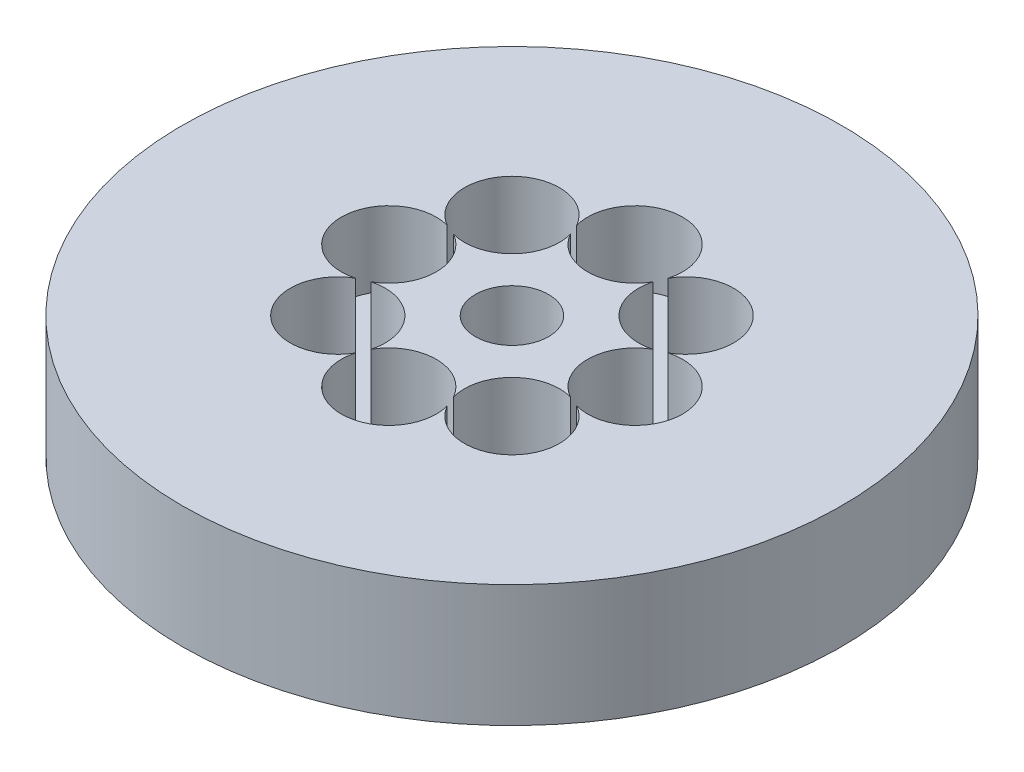
ISO-10303-21;
HEADER;
FILE_DESCRIPTION(('STEP AP214'),'2;1');
FILE_NAME('part.step','',(''),(''),'','','');
FILE_SCHEMA(('AUTOMOTIVE_DESIGN { 1 0 10303 214 1 1 1 1 }'));
ENDSEC;
DATA;
#1=APPLICATION_CONTEXT('core data for automotive mechanical design processes');
#2=APPLICATION_PROTOCOL_DEFINITION('international standard','automotive_design',2000,#1);
#3=PRODUCT_CONTEXT('',#1,'mechanical');
#4=PRODUCT('Part','Part','',(#3));
#5=PRODUCT_RELATED_PRODUCT_CATEGORY('part','',(#4));
#6=PRODUCT_DEFINITION_FORMATION('','',#4);
#7=PRODUCT_DEFINITION_CONTEXT('part definition',#1,'design');
#8=PRODUCT_DEFINITION('design','',#6,#7);
#9=PRODUCT_DEFINITION_SHAPE('','',#8);
#10=(LENGTH_UNIT() NAMED_UNIT(*) SI_UNIT(.MILLI.,.METRE.));
#11=(NAMED_UNIT(*) PLANE_ANGLE_UNIT() SI_UNIT($,.RADIAN.));
#12=(NAMED_UNIT(*) SI_UNIT($,.STERADIAN.) SOLID_ANGLE_UNIT());
#13=UNCERTAINTY_MEASURE_WITH_UNIT(LENGTH_MEASURE(1.E-05),#10,'distance_accuracy_value','');
#14=(GEOMETRIC_REPRESENTATION_CONTEXT(3) GLOBAL_UNCERTAINTY_ASSIGNED_CONTEXT((#13)) GLOBAL_UNIT_ASSIGNED_CONTEXT((#10,
#11,#12)) REPRESENTATION_CONTEXT('',''));
#15=CARTESIAN_POINT('',(0.,0.,0.));
#16=DIRECTION('',(0.,0.,1.));
#17=DIRECTION('',(1.,0.,0.));
#18=AXIS2_PLACEMENT_3D('',#15,#16,#17);
#19=CARTESIAN_POINT('',(0.,25.,0.));
#20=DIRECTION('',(0.,1.,0.));
#21=DIRECTION('',(0.,0.,1.));
#22=AXIS2_PLACEMENT_3D('',#19,#20,#21);
#23=PLANE('',#22);
#24=CARTESIAN_POINT('',(-17.835836391274,25.,17.8358363912741));
#25=DIRECTION('',(0.,1.,0.));
#26=DIRECTION('',(0.707106781186549,0.,0.707106781186546));
#27=AXIS2_PLACEMENT_3D('',#24,#25,#26);
#28=CIRCLE('',#27,9.72663135384918);
#29=CARTESIAN_POINT('',(-8.45981113762226,25.,20.4237907835628));
#30=VERTEX_POINT('',#29);
#31=CARTESIAN_POINT('',(-20.4237907835627,25.,8.45981113762233));
#32=VERTEX_POINT('',#31);
#33=EDGE_CURVE('E248',#30,#32,#28,.T.);
#34=ORIENTED_EDGE('',*,*,#33,.F.);
#35=CARTESIAN_POINT('',(0.,25.,25.2236817208074));
#36=DIRECTION('',(0.,1.,0.));
#37=DIRECTION('',(1.,0.,0.));
#38=AXIS2_PLACEMENT_3D('',#35,#36,#37);
#39=CIRCLE('',#38,9.72663135384918);
#40=CARTESIAN_POINT('',(8.4598111376224,25.,20.4237907835627));
#41=VERTEX_POINT('',#40);
#42=EDGE_CURVE('E230',#41,#30,#39,.T.);
#43=ORIENTED_EDGE('',*,*,#42,.F.);
#44=CARTESIAN_POINT('',(17.8358363912741,25.,17.835836391274));
#45=DIRECTION('',(0.,1.,0.));
#46=DIRECTION('',(0.707106781186544,0.,-0.707106781186551));
#47=AXIS2_PLACEMENT_3D('',#44,#45,#46);
#48=CIRCLE('',#47,9.72663135384918);
#49=CARTESIAN_POINT('',(20.4237907835622,25.,8.45981113762202));
#50=VERTEX_POINT('',#49);
#51=EDGE_CURVE('E204',#50,#41,#48,.T.);
#52=ORIENTED_EDGE('',*,*,#51,.F.);
#53=CARTESIAN_POINT('',(25.2236817208074,25.,0.));
#54=DIRECTION('',(0.,1.,0.));
#55=DIRECTION('',(0.,0.,-1.));
#56=AXIS2_PLACEMENT_3D('',#53,#54,#55);
#57=CIRCLE('',#56,9.72663135384918);
#58=CARTESIAN_POINT('',(20.4237907835633,25.,-8.45981113762264));
#59=VERTEX_POINT('',#58);
#60=EDGE_CURVE('E206',#59,#50,#57,.T.);
#61=ORIENTED_EDGE('',*,*,#60,.F.);
#62=CARTESIAN_POINT('',(17.8358363912739,25.,-17.8358363912742));
#63=DIRECTION('',(0.,1.,0.));
#64=DIRECTION('',(-0.707106781186554,0.,-0.707106781186541));
#65=AXIS2_PLACEMENT_3D('',#62,#63,#64);
#66=CIRCLE('',#65,9.72663135384918);
#67=CARTESIAN_POINT('',(8.45981113762211,25.,-20.4237907835628));
#68=VERTEX_POINT('',#67);
#69=EDGE_CURVE('E186',#68,#59,#66,.T.);
#70=ORIENTED_EDGE('',*,*,#69,.F.);
#71=CARTESIAN_POINT('',(-2.64204042075353E-13,25.,-25.2236817208074));
#72=DIRECTION('',(0.,1.,0.));
#73=DIRECTION('',(-1.,0.,0.));
#74=AXIS2_PLACEMENT_3D('',#71,#72,#73);
#75=CIRCLE('',#74,9.72663135384918);
#76=CARTESIAN_POINT('',(-8.45981113762254,25.,-20.4237907835626));
#77=VERTEX_POINT('',#76);
#78=EDGE_CURVE('E163',#77,#68,#75,.T.);
#79=ORIENTED_EDGE('',*,*,#78,.F.);
#80=CARTESIAN_POINT('',(-17.8358363912743,25.,-17.8358363912738));
#81=DIRECTION('',(0.,1.,0.));
#82=DIRECTION('',(-0.707106781186539,0.,0.707106781186556));
#83=AXIS2_PLACEMENT_3D('',#80,#81,#82);
#84=CIRCLE('',#83,9.72663135384918);
#85=CARTESIAN_POINT('',(-20.4237907835617,25.,-8.45981113762171));
#86=VERTEX_POINT('',#85);
#87=EDGE_CURVE('E182',#86,#77,#84,.T.);
#88=ORIENTED_EDGE('',*,*,#87,.F.);
#89=CARTESIAN_POINT('',(-25.2236817208074,25.,0.));
#90=DIRECTION('',(0.,1.,0.));
#91=DIRECTION('',(0.,0.,1.));
#92=AXIS2_PLACEMENT_3D('',#89,#90,#91);
#93=CIRCLE('',#92,9.72663135384918);
#94=EDGE_CURVE('E261',#32,#86,#93,.T.);
#95=ORIENTED_EDGE('',*,*,#94,.F.);
#96=EDGE_LOOP('',(#34,#43,#52,#61,#70,#79,#88,#95));
#97=FACE_BOUND('',#96,.T.);
#98=CARTESIAN_POINT('',(0.,25.,0.));
#99=DIRECTION('',(0.,1.,0.));
#100=DIRECTION('',(0.,0.,1.));
#101=AXIS2_PLACEMENT_3D('',#98,#99,#100);
#102=CIRCLE('',#101,7.5);
#103=CARTESIAN_POINT('',(0.,25.,7.5));
#104=VERTEX_POINT('',#103);
#105=EDGE_CURVE('E262',#104,#104,#102,.T.);
#106=ORIENTED_EDGE('',*,*,#105,.F.);
#107=EDGE_LOOP('',(#106));
#108=FACE_BOUND('',#107,.T.);
#109=ADVANCED_FACE('F39',(#97,#108),#23,.T.);
#110=CARTESIAN_POINT('',(-25.2236817208074,9.76931969027989,0.));
#111=DIRECTION('',(0.,1.,0.));
#112=DIRECTION('',(0.,0.,1.));
#113=AXIS2_PLACEMENT_3D('',#110,#111,#112);
#114=CYLINDRICAL_SURFACE('',#113,9.72663135384918);
#115=CARTESIAN_POINT('',(-25.2236817208074,9.76931969027989,0.));
#116=DIRECTION('',(0.,1.,0.));
#117=DIRECTION('',(0.,0.,1.));
#118=AXIS2_PLACEMENT_3D('',#115,#116,#117);
#119=CIRCLE('',#118,9.72663135384918);
#120=CARTESIAN_POINT('',(-20.4237907835627,9.76931969027989,8.45981113762233));
#121=VERTEX_POINT('',#120);
#122=CARTESIAN_POINT('',(-20.4237907835617,9.76931969027989,-8.45981113762172));
#123=VERTEX_POINT('',#122);
#124=EDGE_CURVE('E257',#121,#123,#119,.T.);
#125=ORIENTED_EDGE('',*,*,#124,.F.);
#126=DIRECTION('',(0.,1.,0.));
#127=VECTOR('',#126,1.);
#128=CARTESIAN_POINT('',(-20.4237907835627,17.3846598451399,8.45981113762233));
#129=LINE('',#128,#127);
#130=EDGE_CURVE('E255',#121,#32,#129,.T.);
#131=ORIENTED_EDGE('',*,*,#130,.T.);
#132=ORIENTED_EDGE('',*,*,#94,.T.);
#133=DIRECTION('',(0.,1.,0.));
#134=VECTOR('',#133,1.);
#135=CARTESIAN_POINT('',(-20.4237907835617,17.3846598451399,-8.45981113762171));
#136=LINE('',#135,#134);
#137=EDGE_CURVE('E250',#86,#123,#136,.F.);
#138=ORIENTED_EDGE('',*,*,#137,.T.);
#139=EDGE_LOOP('',(#125,#131,#132,#138));
#140=FACE_BOUND('',#139,.T.);
#141=ADVANCED_FACE('F277',(#140),#114,.F.);
#142=CARTESIAN_POINT('',(0.,25.,0.));
#143=DIRECTION('',(0.,-1.,0.));
#144=DIRECTION('',(0.,0.,-1.));
#145=AXIS2_PLACEMENT_3D('',#142,#143,#144);
#146=CYLINDRICAL_SURFACE('',#145,67.5);
#147=CARTESIAN_POINT('',(0.,25.,0.));
#148=DIRECTION('',(0.,1.,0.));
#149=DIRECTION('',(0.,0.,1.));
#150=AXIS2_PLACEMENT_3D('',#147,#148,#149);
#151=CIRCLE('',#150,67.5);
#152=CARTESIAN_POINT('',(0.,25.,67.5));
#153=VERTEX_POINT('',#152);
#154=EDGE_CURVE('E11',#153,#153,#151,.T.);
#155=ORIENTED_EDGE('',*,*,#154,.F.);
#156=EDGE_LOOP('',(#155));
#157=FACE_BOUND('',#156,.T.);
#158=CARTESIAN_POINT('',(0.,0.,0.));
#159=DIRECTION('',(0.,1.,0.));
#160=DIRECTION('',(0.,0.,1.));
#161=AXIS2_PLACEMENT_3D('',#158,#159,#160);
#162=CIRCLE('',#161,67.5);
#163=CARTESIAN_POINT('',(0.,0.,67.5));
#164=VERTEX_POINT('',#163);
#165=EDGE_CURVE('E43',#164,#164,#162,.T.);
#166=ORIENTED_EDGE('',*,*,#165,.T.);
#167=EDGE_LOOP('',(#166));
#168=FACE_BOUND('',#167,.T.);
#169=ADVANCED_FACE('F41',(#157,#168),#146,.T.);
#170=CARTESIAN_POINT('',(-22.6357273285186,25.,9.37602525365175));
#171=VERTEX_POINT('',#170);
#172=CARTESIAN_POINT('',(-9.37602525365167,25.,22.6357273285187));
#173=VERTEX_POINT('',#172);
#174=EDGE_CURVE('E242',#171,#173,#28,.T.);
#175=ORIENTED_EDGE('',*,*,#174,.F.);
#176=CARTESIAN_POINT('',(-22.63572732852,25.,-9.37602525365212));
#177=VERTEX_POINT('',#176);
#178=EDGE_CURVE('E260',#177,#171,#93,.T.);
#179=ORIENTED_EDGE('',*,*,#178,.F.);
#180=CARTESIAN_POINT('',(-9.37602525365199,25.,-22.6357273285185));
#181=VERTEX_POINT('',#180);
#182=EDGE_CURVE('E178',#181,#177,#84,.T.);
#183=ORIENTED_EDGE('',*,*,#182,.F.);
#184=CARTESIAN_POINT('',(9.37602525365151,25.,-22.6357273285187));
#185=VERTEX_POINT('',#184);
#186=EDGE_CURVE('E168',#185,#181,#75,.T.);
#187=ORIENTED_EDGE('',*,*,#186,.F.);
#188=CARTESIAN_POINT('',(22.635727328518,25.,-9.37602525365156));
#189=VERTEX_POINT('',#188);
#190=EDGE_CURVE('E195',#189,#185,#66,.T.);
#191=ORIENTED_EDGE('',*,*,#190,.F.);
#192=CARTESIAN_POINT('',(22.6357273285193,25.,9.37602525365193));
#193=VERTEX_POINT('',#192);
#194=EDGE_CURVE('E199',#193,#189,#57,.T.);
#195=ORIENTED_EDGE('',*,*,#194,.F.);
#196=CARTESIAN_POINT('',(9.37602525365183,25.,22.6357273285186));
#197=VERTEX_POINT('',#196);
#198=EDGE_CURVE('E213',#197,#193,#48,.T.);
#199=ORIENTED_EDGE('',*,*,#198,.F.);
#200=EDGE_CURVE('E222',#173,#197,#39,.T.);
#201=ORIENTED_EDGE('',*,*,#200,.F.);
#202=EDGE_LOOP('',(#175,#179,#183,#187,#191,#195,#199,#201));
#203=FACE_BOUND('',#202,.T.);
#204=ORIENTED_EDGE('',*,*,#154,.T.);
#205=EDGE_LOOP('',(#204));
#206=FACE_BOUND('',#205,.T.);
#207=ADVANCED_FACE('F319',(#203,#206),#23,.T.);
#208=CARTESIAN_POINT('',(0.,0.,0.));
#209=DIRECTION('',(0.,1.,0.));
#210=DIRECTION('',(0.,0.,1.));
#211=AXIS2_PLACEMENT_3D('',#208,#209,#210);
#212=PLANE('',#211);
#213=CARTESIAN_POINT('',(0.,0.,0.));
#214=DIRECTION('',(0.,1.,0.));
#215=DIRECTION('',(0.,0.,1.));
#216=AXIS2_PLACEMENT_3D('',#213,#214,#215);
#217=CIRCLE('',#216,7.5);
#218=CARTESIAN_POINT('',(0.,0.,7.5));
#219=VERTEX_POINT('',#218);
#220=EDGE_CURVE('E270',#219,#219,#217,.T.);
#221=ORIENTED_EDGE('',*,*,#220,.T.);
#222=EDGE_LOOP('',(#221));
#223=FACE_BOUND('',#222,.T.);
#224=ORIENTED_EDGE('',*,*,#165,.F.);
#225=EDGE_LOOP('',(#224));
#226=FACE_BOUND('',#225,.T.);
#227=ADVANCED_FACE('F327',(#223,#226),#212,.F.);
#228=CARTESIAN_POINT('',(0.,25.,0.));
#229=DIRECTION('',(0.,-1.,0.));
#230=DIRECTION('',(0.,0.,-1.));
#231=AXIS2_PLACEMENT_3D('',#228,#229,#230);
#232=CYLINDRICAL_SURFACE('',#231,7.5);
#233=ORIENTED_EDGE('',*,*,#105,.T.);
#234=EDGE_LOOP('',(#233));
#235=FACE_BOUND('',#234,.T.);
#236=ORIENTED_EDGE('',*,*,#220,.F.);
#237=EDGE_LOOP('',(#236));
#238=FACE_BOUND('',#237,.T.);
#239=ADVANCED_FACE('F331',(#235,#238),#232,.F.);
#240=ORIENTED_EDGE('',*,*,#178,.T.);
#241=DIRECTION('',(0.,1.,0.));
#242=VECTOR('',#241,1.);
#243=CARTESIAN_POINT('',(-22.6357273285186,17.3846598451399,9.37602525365175));
#244=LINE('',#243,#242);
#245=CARTESIAN_POINT('',(-22.6357273285186,9.76931969027989,9.37602525365175));
#246=VERTEX_POINT('',#245);
#247=EDGE_CURVE('E65',#171,#246,#244,.F.);
#248=ORIENTED_EDGE('',*,*,#247,.T.);
#249=CARTESIAN_POINT('',(-22.63572732852,9.76931969027989,-9.37602525365211));
#250=VERTEX_POINT('',#249);
#251=EDGE_CURVE('E256',#250,#246,#119,.T.);
#252=ORIENTED_EDGE('',*,*,#251,.F.);
#253=DIRECTION('',(0.,1.,0.));
#254=VECTOR('',#253,1.);
#255=CARTESIAN_POINT('',(-22.63572732852,17.3846598451399,-9.37602525365212));
#256=LINE('',#255,#254);
#257=EDGE_CURVE('E180',#250,#177,#256,.T.);
#258=ORIENTED_EDGE('',*,*,#257,.T.);
#259=EDGE_LOOP('',(#240,#248,#252,#258));
#260=FACE_BOUND('',#259,.T.);
#261=ADVANCED_FACE('F312',(#260),#114,.F.);
#262=CARTESIAN_POINT('',(-25.2236817208074,9.76931969027989,0.));
#263=DIRECTION('',(0.,1.,0.));
#264=DIRECTION('',(0.,0.,1.));
#265=AXIS2_PLACEMENT_3D('',#262,#263,#264);
#266=PLANE('',#265);
#267=CARTESIAN_POINT('',(-17.835836391274,9.76931969027989,17.8358363912741));
#268=DIRECTION('',(0.,1.,0.));
#269=DIRECTION('',(0.707106781186549,0.,0.707106781186546));
#270=AXIS2_PLACEMENT_3D('',#267,#268,#269);
#271=CIRCLE('',#270,9.72663135384918);
#272=CARTESIAN_POINT('',(-8.45981113762226,9.76931969027989,20.4237907835628));
#273=VERTEX_POINT('',#272);
#274=EDGE_CURVE('E243',#273,#121,#271,.T.);
#275=ORIENTED_EDGE('',*,*,#274,.T.);
#276=ORIENTED_EDGE('',*,*,#124,.T.);
#277=CARTESIAN_POINT('',(-17.8358363912743,9.76931969027989,-17.8358363912738));
#278=DIRECTION('',(0.,1.,0.));
#279=DIRECTION('',(-0.707106781186539,0.,0.707106781186556));
#280=AXIS2_PLACEMENT_3D('',#277,#278,#279);
#281=CIRCLE('',#280,9.72663135384918);
#282=CARTESIAN_POINT('',(-8.45981113762254,9.76931969027989,-20.4237907835626));
#283=VERTEX_POINT('',#282);
#284=EDGE_CURVE('E53',#123,#283,#281,.T.);
#285=ORIENTED_EDGE('',*,*,#284,.T.);
#286=CARTESIAN_POINT('',(-2.64204042075353E-13,9.76931969027989,-25.2236817208074));
#287=DIRECTION('',(0.,1.,0.));
#288=DIRECTION('',(-1.,0.,0.));
#289=AXIS2_PLACEMENT_3D('',#286,#287,#288);
#290=CIRCLE('',#289,9.72663135384918);
#291=CARTESIAN_POINT('',(8.45981113762211,9.76931969027989,-20.4237907835628));
#292=VERTEX_POINT('',#291);
#293=EDGE_CURVE('E162',#283,#292,#290,.T.);
#294=ORIENTED_EDGE('',*,*,#293,.T.);
#295=CARTESIAN_POINT('',(17.8358363912739,9.76931969027989,-17.8358363912742));
#296=DIRECTION('',(0.,1.,0.));
#297=DIRECTION('',(-0.707106781186554,0.,-0.707106781186541));
#298=AXIS2_PLACEMENT_3D('',#295,#296,#297);
#299=CIRCLE('',#298,9.72663135384918);
#300=CARTESIAN_POINT('',(20.4237907835633,9.76931969027989,-8.45981113762264));
#301=VERTEX_POINT('',#300);
#302=EDGE_CURVE('E191',#292,#301,#299,.T.);
#303=ORIENTED_EDGE('',*,*,#302,.T.);
#304=CARTESIAN_POINT('',(25.2236817208074,9.76931969027989,0.));
#305=DIRECTION('',(0.,1.,0.));
#306=DIRECTION('',(0.,0.,-1.));
#307=AXIS2_PLACEMENT_3D('',#304,#305,#306);
#308=CIRCLE('',#307,9.72663135384918);
#309=CARTESIAN_POINT('',(20.4237907835622,9.76931969027989,8.45981113762202));
#310=VERTEX_POINT('',#309);
#311=EDGE_CURVE('E203',#301,#310,#308,.T.);
#312=ORIENTED_EDGE('',*,*,#311,.T.);
#313=CARTESIAN_POINT('',(17.8358363912741,9.76931969027989,17.835836391274));
#314=DIRECTION('',(0.,1.,0.));
#315=DIRECTION('',(0.707106781186544,0.,-0.707106781186551));
#316=AXIS2_PLACEMENT_3D('',#313,#314,#315);
#317=CIRCLE('',#316,9.72663135384918);
#318=CARTESIAN_POINT('',(8.4598111376224,9.76931969027989,20.4237907835627));
#319=VERTEX_POINT('',#318);
#320=EDGE_CURVE('E215',#310,#319,#317,.T.);
#321=ORIENTED_EDGE('',*,*,#320,.T.);
#322=CARTESIAN_POINT('',(0.,9.76931969027989,25.2236817208074));
#323=DIRECTION('',(0.,1.,0.));
#324=DIRECTION('',(1.,0.,0.));
#325=AXIS2_PLACEMENT_3D('',#322,#323,#324);
#326=CIRCLE('',#325,9.72663135384918);
#327=EDGE_CURVE('E225',#319,#273,#326,.T.);
#328=ORIENTED_EDGE('',*,*,#327,.T.);
#329=EDGE_LOOP('',(#275,#276,#285,#294,#303,#312,#321,#328));
#330=FACE_BOUND('',#329,.T.);
#331=ORIENTED_EDGE('',*,*,#251,.T.);
#332=CARTESIAN_POINT('',(-9.37602525365167,9.76931969027989,22.6357273285187));
#333=VERTEX_POINT('',#332);
#334=EDGE_CURVE('E247',#246,#333,#271,.T.);
#335=ORIENTED_EDGE('',*,*,#334,.T.);
#336=CARTESIAN_POINT('',(9.37602525365183,9.76931969027989,22.6357273285186));
#337=VERTEX_POINT('',#336);
#338=EDGE_CURVE('E226',#333,#337,#326,.T.);
#339=ORIENTED_EDGE('',*,*,#338,.T.);
#340=CARTESIAN_POINT('',(22.6357273285193,9.76931969027989,9.37602525365193));
#341=VERTEX_POINT('',#340);
#342=EDGE_CURVE('E207',#337,#341,#317,.T.);
#343=ORIENTED_EDGE('',*,*,#342,.T.);
#344=CARTESIAN_POINT('',(22.635727328518,9.76931969027989,-9.37602525365156));
#345=VERTEX_POINT('',#344);
#346=EDGE_CURVE('E202',#341,#345,#308,.T.);
#347=ORIENTED_EDGE('',*,*,#346,.T.);
#348=CARTESIAN_POINT('',(9.37602525365151,9.76931969027989,-22.6357273285187));
#349=VERTEX_POINT('',#348);
#350=EDGE_CURVE('E159',#345,#349,#299,.T.);
#351=ORIENTED_EDGE('',*,*,#350,.T.);
#352=CARTESIAN_POINT('',(-9.37602525365199,9.76931969027989,-22.6357273285185));
#353=VERTEX_POINT('',#352);
#354=EDGE_CURVE('E155',#349,#353,#290,.T.);
#355=ORIENTED_EDGE('',*,*,#354,.T.);
#356=EDGE_CURVE('E160',#353,#250,#281,.T.);
#357=ORIENTED_EDGE('',*,*,#356,.T.);
#358=EDGE_LOOP('',(#331,#335,#339,#343,#347,#351,#355,#357));
#359=FACE_BOUND('',#358,.T.);
#360=ADVANCED_FACE('F154',(#330,#359),#266,.T.);
#361=CARTESIAN_POINT('',(-17.835836391274,9.76931969027989,17.8358363912741));
#362=DIRECTION('',(0.,1.,0.));
#363=DIRECTION('',(0.,0.,1.));
#364=AXIS2_PLACEMENT_3D('',#361,#362,#363);
#365=CYLINDRICAL_SURFACE('',#364,9.72663135384918);
#366=ORIENTED_EDGE('',*,*,#274,.F.);
#367=DIRECTION('',(0.,1.,0.));
#368=VECTOR('',#367,1.);
#369=CARTESIAN_POINT('',(-8.45981113762226,17.3846598451399,20.4237907835628));
#370=LINE('',#369,#368);
#371=EDGE_CURVE('E241',#273,#30,#370,.T.);
#372=ORIENTED_EDGE('',*,*,#371,.T.);
#373=ORIENTED_EDGE('',*,*,#33,.T.);
#374=ORIENTED_EDGE('',*,*,#130,.F.);
#375=EDGE_LOOP('',(#366,#372,#373,#374));
#376=FACE_BOUND('',#375,.T.);
#377=ADVANCED_FACE('F307',(#376),#365,.F.);
#378=ORIENTED_EDGE('',*,*,#174,.T.);
#379=DIRECTION('',(0.,1.,0.));
#380=VECTOR('',#379,1.);
#381=CARTESIAN_POINT('',(-9.37602525365167,17.3846598451399,22.6357273285187));
#382=LINE('',#381,#380);
#383=EDGE_CURVE('E236',#173,#333,#382,.F.);
#384=ORIENTED_EDGE('',*,*,#383,.T.);
#385=ORIENTED_EDGE('',*,*,#334,.F.);
#386=ORIENTED_EDGE('',*,*,#247,.F.);
#387=EDGE_LOOP('',(#378,#384,#385,#386));
#388=FACE_BOUND('',#387,.T.);
#389=ADVANCED_FACE('F310',(#388),#365,.F.);
#390=CARTESIAN_POINT('',(-17.8358363912743,9.76931969027989,-17.8358363912738));
#391=DIRECTION('',(0.,1.,0.));
#392=DIRECTION('',(0.,0.,1.));
#393=AXIS2_PLACEMENT_3D('',#390,#391,#392);
#394=CYLINDRICAL_SURFACE('',#393,9.72663135384918);
#395=ORIENTED_EDGE('',*,*,#356,.F.);
#396=DIRECTION('',(0.,1.,0.));
#397=VECTOR('',#396,1.);
#398=CARTESIAN_POINT('',(-9.37602525365199,17.3846598451399,-22.6357273285185));
#399=LINE('',#398,#397);
#400=EDGE_CURVE('E170',#181,#353,#399,.F.);
#401=ORIENTED_EDGE('',*,*,#400,.F.);
#402=ORIENTED_EDGE('',*,*,#182,.T.);
#403=ORIENTED_EDGE('',*,*,#257,.F.);
#404=EDGE_LOOP('',(#395,#401,#402,#403));
#405=FACE_BOUND('',#404,.T.);
#406=ADVANCED_FACE('F174',(#405),#394,.F.);
#407=ORIENTED_EDGE('',*,*,#87,.T.);
#408=DIRECTION('',(0.,1.,0.));
#409=VECTOR('',#408,1.);
#410=CARTESIAN_POINT('',(-8.45981113762254,17.3846598451399,-20.4237907835626));
#411=LINE('',#410,#409);
#412=EDGE_CURVE('E172',#283,#77,#411,.T.);
#413=ORIENTED_EDGE('',*,*,#412,.F.);
#414=ORIENTED_EDGE('',*,*,#284,.F.);
#415=ORIENTED_EDGE('',*,*,#137,.F.);
#416=EDGE_LOOP('',(#407,#413,#414,#415));
#417=FACE_BOUND('',#416,.T.);
#418=ADVANCED_FACE('F278',(#417),#394,.F.);
#419=CARTESIAN_POINT('',(0.,9.76931969027989,25.2236817208074));
#420=DIRECTION('',(0.,1.,0.));
#421=DIRECTION('',(0.,0.,1.));
#422=AXIS2_PLACEMENT_3D('',#419,#420,#421);
#423=CYLINDRICAL_SURFACE('',#422,9.72663135384918);
#424=ORIENTED_EDGE('',*,*,#327,.F.);
#425=DIRECTION('',(0.,1.,0.));
#426=VECTOR('',#425,1.);
#427=CARTESIAN_POINT('',(8.4598111376224,17.3846598451399,20.4237907835627));
#428=LINE('',#427,#426);
#429=EDGE_CURVE('E217',#319,#41,#428,.T.);
#430=ORIENTED_EDGE('',*,*,#429,.T.);
#431=ORIENTED_EDGE('',*,*,#42,.T.);
#432=ORIENTED_EDGE('',*,*,#371,.F.);
#433=EDGE_LOOP('',(#424,#430,#431,#432));
#434=FACE_BOUND('',#433,.T.);
#435=ADVANCED_FACE('F303',(#434),#423,.F.);
#436=CARTESIAN_POINT('',(17.8358363912739,9.76931969027989,-17.8358363912742));
#437=DIRECTION('',(0.,1.,0.));
#438=DIRECTION('',(0.,0.,1.));
#439=AXIS2_PLACEMENT_3D('',#436,#437,#438);
#440=CYLINDRICAL_SURFACE('',#439,9.72663135384918);
#441=DIRECTION('',(0.,1.,0.));
#442=VECTOR('',#441,1.);
#443=CARTESIAN_POINT('',(8.45981113762212,17.3846598451399,-20.4237907835628));
#444=LINE('',#443,#442);
#445=EDGE_CURVE('E237',#292,#68,#444,.T.);
#446=ORIENTED_EDGE('',*,*,#445,.T.);
#447=ORIENTED_EDGE('',*,*,#69,.T.);
#448=DIRECTION('',(0.,1.,0.));
#449=VECTOR('',#448,1.);
#450=CARTESIAN_POINT('',(20.4237907835633,17.3846598451399,-8.45981113762264));
#451=LINE('',#450,#449);
#452=EDGE_CURVE('E197',#301,#59,#451,.T.);
#453=ORIENTED_EDGE('',*,*,#452,.F.);
#454=ORIENTED_EDGE('',*,*,#302,.F.);
#455=EDGE_LOOP('',(#446,#447,#453,#454));
#456=FACE_BOUND('',#455,.T.);
#457=ADVANCED_FACE('F294',(#456),#440,.F.);
#458=CARTESIAN_POINT('',(17.8358363912741,9.76931969027989,17.835836391274));
#459=DIRECTION('',(0.,1.,0.));
#460=DIRECTION('',(0.,0.,1.));
#461=AXIS2_PLACEMENT_3D('',#458,#459,#460);
#462=CYLINDRICAL_SURFACE('',#461,9.72663135384918);
#463=DIRECTION('',(0.,1.,0.));
#464=VECTOR('',#463,1.);
#465=CARTESIAN_POINT('',(20.4237907835622,17.3846598451399,8.45981113762202));
#466=LINE('',#465,#464);
#467=EDGE_CURVE('E235',#310,#50,#466,.T.);
#468=ORIENTED_EDGE('',*,*,#467,.T.);
#469=ORIENTED_EDGE('',*,*,#51,.T.);
#470=ORIENTED_EDGE('',*,*,#429,.F.);
#471=ORIENTED_EDGE('',*,*,#320,.F.);
#472=EDGE_LOOP('',(#468,#469,#470,#471));
#473=FACE_BOUND('',#472,.T.);
#474=ADVANCED_FACE('F301',(#473),#462,.F.);
#475=ORIENTED_EDGE('',*,*,#200,.T.);
#476=DIRECTION('',(0.,1.,0.));
#477=VECTOR('',#476,1.);
#478=CARTESIAN_POINT('',(9.37602525365183,17.3846598451399,22.6357273285186));
#479=LINE('',#478,#477);
#480=EDGE_CURVE('E211',#197,#337,#479,.F.);
#481=ORIENTED_EDGE('',*,*,#480,.T.);
#482=ORIENTED_EDGE('',*,*,#338,.F.);
#483=ORIENTED_EDGE('',*,*,#383,.F.);
#484=EDGE_LOOP('',(#475,#481,#482,#483));
#485=FACE_BOUND('',#484,.T.);
#486=ADVANCED_FACE('F348',(#485),#423,.F.);
#487=DIRECTION('',(0.,1.,0.));
#488=VECTOR('',#487,1.);
#489=CARTESIAN_POINT('',(22.6357273285193,17.3846598451399,9.37602525365193));
#490=LINE('',#489,#488);
#491=EDGE_CURVE('E223',#193,#341,#490,.F.);
#492=ORIENTED_EDGE('',*,*,#491,.T.);
#493=ORIENTED_EDGE('',*,*,#342,.F.);
#494=ORIENTED_EDGE('',*,*,#480,.F.);
#495=ORIENTED_EDGE('',*,*,#198,.T.);
#496=EDGE_LOOP('',(#492,#493,#494,#495));
#497=FACE_BOUND('',#496,.T.);
#498=ADVANCED_FACE('F353',(#497),#462,.F.);
#499=CARTESIAN_POINT('',(25.2236817208074,9.76931969027989,0.));
#500=DIRECTION('',(0.,1.,0.));
#501=DIRECTION('',(0.,0.,1.));
#502=AXIS2_PLACEMENT_3D('',#499,#500,#501);
#503=CYLINDRICAL_SURFACE('',#502,9.72663135384918);
#504=ORIENTED_EDGE('',*,*,#311,.F.);
#505=ORIENTED_EDGE('',*,*,#452,.T.);
#506=ORIENTED_EDGE('',*,*,#60,.T.);
#507=ORIENTED_EDGE('',*,*,#467,.F.);
#508=EDGE_LOOP('',(#504,#505,#506,#507));
#509=FACE_BOUND('',#508,.T.);
#510=ADVANCED_FACE('F296',(#509),#503,.F.);
#511=ORIENTED_EDGE('',*,*,#194,.T.);
#512=DIRECTION('',(0.,1.,0.));
#513=VECTOR('',#512,1.);
#514=CARTESIAN_POINT('',(22.635727328518,17.3846598451399,-9.37602525365156));
#515=LINE('',#514,#513);
#516=EDGE_CURVE('E189',#189,#345,#515,.F.);
#517=ORIENTED_EDGE('',*,*,#516,.T.);
#518=ORIENTED_EDGE('',*,*,#346,.F.);
#519=ORIENTED_EDGE('',*,*,#491,.F.);
#520=EDGE_LOOP('',(#511,#517,#518,#519));
#521=FACE_BOUND('',#520,.T.);
#522=ADVANCED_FACE('F357',(#521),#503,.F.);
#523=DIRECTION('',(0.,1.,0.));
#524=VECTOR('',#523,1.);
#525=CARTESIAN_POINT('',(9.37602525365151,17.3846598451399,-22.6357273285187));
#526=LINE('',#525,#524);
#527=EDGE_CURVE('E233',#185,#349,#526,.F.);
#528=ORIENTED_EDGE('',*,*,#527,.T.);
#529=ORIENTED_EDGE('',*,*,#350,.F.);
#530=ORIENTED_EDGE('',*,*,#516,.F.);
#531=ORIENTED_EDGE('',*,*,#190,.T.);
#532=EDGE_LOOP('',(#528,#529,#530,#531));
#533=FACE_BOUND('',#532,.T.);
#534=ADVANCED_FACE('F362',(#533),#440,.F.);
#535=CARTESIAN_POINT('',(-2.64204042075353E-13,9.76931969027989,-25.2236817208074));
#536=DIRECTION('',(0.,1.,0.));
#537=DIRECTION('',(0.,0.,1.));
#538=AXIS2_PLACEMENT_3D('',#535,#536,#537);
#539=CYLINDRICAL_SURFACE('',#538,9.72663135384918);
#540=ORIENTED_EDGE('',*,*,#293,.F.);
#541=ORIENTED_EDGE('',*,*,#412,.T.);
#542=ORIENTED_EDGE('',*,*,#78,.T.);
#543=ORIENTED_EDGE('',*,*,#445,.F.);
#544=EDGE_LOOP('',(#540,#541,#542,#543));
#545=FACE_BOUND('',#544,.T.);
#546=ADVANCED_FACE('F288',(#545),#539,.F.);
#547=ORIENTED_EDGE('',*,*,#186,.T.);
#548=ORIENTED_EDGE('',*,*,#400,.T.);
#549=ORIENTED_EDGE('',*,*,#354,.F.);
#550=ORIENTED_EDGE('',*,*,#527,.F.);
#551=EDGE_LOOP('',(#547,#548,#549,#550));
#552=FACE_BOUND('',#551,.T.);
#553=ADVANCED_FACE('F169',(#552),#539,.F.);
#554=CLOSED_SHELL('',(#109,#141,#169,#207,#227,#239,#261,#360,#377,#389,#406,#418,#435,#457,
#474,#486,#498,#510,#522,#534,#546,#553));
#555=MANIFOLD_SOLID_BREP('B2',#554);
#556=ADVANCED_BREP_SHAPE_REPRESENTATION('',(#18,#555),#14);
#557=SHAPE_DEFINITION_REPRESENTATION(#9,#556);
ENDSEC;
END-ISO-10303-21;
